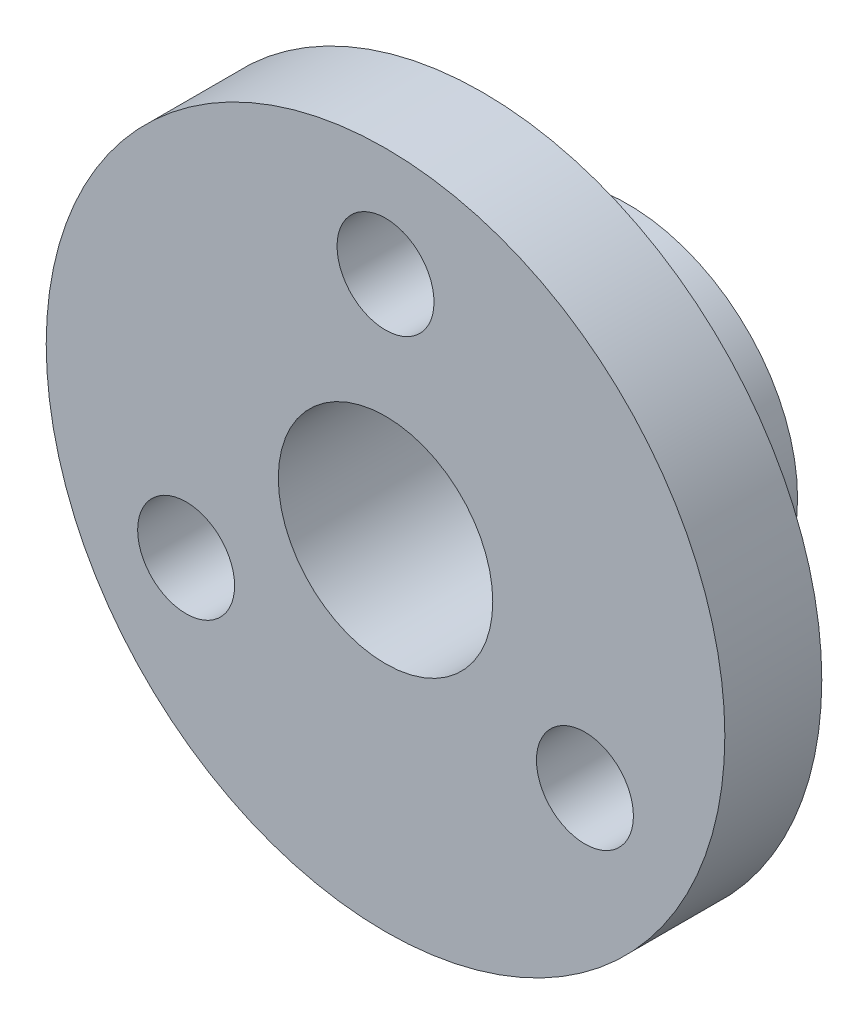
ISO-10303-21;
HEADER;
FILE_DESCRIPTION(('STEP AP214'),'2;1');
FILE_NAME('part.step','',(''),(''),'','','');
FILE_SCHEMA(('AUTOMOTIVE_DESIGN { 1 0 10303 214 1 1 1 1 }'));
ENDSEC;
DATA;
#1=APPLICATION_CONTEXT('core data for automotive mechanical design processes');
#2=APPLICATION_PROTOCOL_DEFINITION('international standard','automotive_design',2000,#1);
#3=PRODUCT_CONTEXT('',#1,'mechanical');
#4=PRODUCT('Part','Part','',(#3));
#5=PRODUCT_RELATED_PRODUCT_CATEGORY('part','',(#4));
#6=PRODUCT_DEFINITION_FORMATION('','',#4);
#7=PRODUCT_DEFINITION_CONTEXT('part definition',#1,'design');
#8=PRODUCT_DEFINITION('design','',#6,#7);
#9=PRODUCT_DEFINITION_SHAPE('','',#8);
#10=(LENGTH_UNIT() NAMED_UNIT(*) SI_UNIT(.MILLI.,.METRE.));
#11=(NAMED_UNIT(*) PLANE_ANGLE_UNIT() SI_UNIT($,.RADIAN.));
#12=(NAMED_UNIT(*) SI_UNIT($,.STERADIAN.) SOLID_ANGLE_UNIT());
#13=UNCERTAINTY_MEASURE_WITH_UNIT(LENGTH_MEASURE(1.E-05),#10,'distance_accuracy_value','');
#14=(GEOMETRIC_REPRESENTATION_CONTEXT(3) GLOBAL_UNCERTAINTY_ASSIGNED_CONTEXT((#13)) GLOBAL_UNIT_ASSIGNED_CONTEXT((#10,
#11,#12)) REPRESENTATION_CONTEXT('',''));
#15=CARTESIAN_POINT('',(0.,0.,0.));
#16=DIRECTION('',(0.,0.,1.));
#17=DIRECTION('',(1.,0.,0.));
#18=AXIS2_PLACEMENT_3D('',#15,#16,#17);
#19=CARTESIAN_POINT('',(-30.7119273786528,-38.9047607864826,2.));
#20=DIRECTION('',(0.,0.,1.));
#21=DIRECTION('',(1.,0.,0.));
#22=AXIS2_PLACEMENT_3D('',#19,#20,#21);
#23=PLANE('',#22);
#24=CARTESIAN_POINT('',(-30.7119273786528,-34.1547607864826,2.));
#25=DIRECTION('',(0.,0.,1.));
#26=DIRECTION('',(1.,0.,0.));
#27=AXIS2_PLACEMENT_3D('',#24,#25,#26);
#28=CIRCLE('',#27,0.999999999999998);
#29=CARTESIAN_POINT('',(-29.7119273786528,-34.1547607864826,2.));
#30=VERTEX_POINT('',#29);
#31=EDGE_CURVE('E53',#30,#30,#28,.T.);
#32=ORIENTED_EDGE('',*,*,#31,.F.);
#33=EDGE_LOOP('',(#32));
#34=FACE_BOUND('',#33,.T.);
#35=CARTESIAN_POINT('',(-34.8255480466291,-41.2797607864825,2.));
#36=DIRECTION('',(0.,0.,1.));
#37=DIRECTION('',(1.,0.,0.));
#38=AXIS2_PLACEMENT_3D('',#35,#36,#37);
#39=CIRCLE('',#38,0.999999999999999);
#40=CARTESIAN_POINT('',(-33.8255480466291,-41.2797607864825,2.));
#41=VERTEX_POINT('',#40);
#42=EDGE_CURVE('E56',#41,#41,#39,.T.);
#43=ORIENTED_EDGE('',*,*,#42,.F.);
#44=EDGE_LOOP('',(#43));
#45=FACE_BOUND('',#44,.T.);
#46=CARTESIAN_POINT('',(-26.5983067106769,-41.2797607864827,2.));
#47=DIRECTION('',(0.,0.,1.));
#48=DIRECTION('',(1.,0.,0.));
#49=AXIS2_PLACEMENT_3D('',#46,#47,#48);
#50=CIRCLE('',#49,0.999999999999996);
#51=CARTESIAN_POINT('',(-25.5983067106769,-41.2797607864827,2.));
#52=VERTEX_POINT('',#51);
#53=EDGE_CURVE('E59',#52,#52,#50,.T.);
#54=ORIENTED_EDGE('',*,*,#53,.F.);
#55=EDGE_LOOP('',(#54));
#56=FACE_BOUND('',#55,.T.);
#57=CARTESIAN_POINT('',(-30.7119273786528,-38.9047607864826,2.));
#58=DIRECTION('',(0.,0.,1.));
#59=DIRECTION('',(1.,0.,0.));
#60=AXIS2_PLACEMENT_3D('',#57,#58,#59);
#61=CIRCLE('',#60,7.);
#62=CARTESIAN_POINT('',(-23.7119273786528,-38.9047607864826,2.));
#63=VERTEX_POINT('',#62);
#64=EDGE_CURVE('E10',#63,#63,#61,.T.);
#65=ORIENTED_EDGE('',*,*,#64,.T.);
#66=EDGE_LOOP('',(#65));
#67=FACE_BOUND('',#66,.T.);
#68=CARTESIAN_POINT('',(-30.7119273786528,-38.9047607864826,2.));
#69=DIRECTION('',(0.,0.,1.));
#70=DIRECTION('',(1.,0.,0.));
#71=AXIS2_PLACEMENT_3D('',#68,#69,#70);
#72=CIRCLE('',#71,2.21235507289356);
#73=CARTESIAN_POINT('',(-28.4995723057593,-38.9047607864826,2.));
#74=VERTEX_POINT('',#73);
#75=EDGE_CURVE('E43',#74,#74,#72,.T.);
#76=ORIENTED_EDGE('',*,*,#75,.F.);
#77=EDGE_LOOP('',(#76));
#78=FACE_BOUND('',#77,.T.);
#79=ADVANCED_FACE('F30',(#34,#45,#56,#67,#78),#23,.T.);
#80=CARTESIAN_POINT('',(-30.7119273786528,-38.9047607864826,0.));
#81=DIRECTION('',(0.,0.,1.));
#82=DIRECTION('',(1.,0.,0.));
#83=AXIS2_PLACEMENT_3D('',#80,#81,#82);
#84=PLANE('',#83);
#85=CARTESIAN_POINT('',(-30.7119273786528,-34.1547607864826,0.));
#86=DIRECTION('',(0.,0.,-1.));
#87=DIRECTION('',(-1.,0.,0.));
#88=AXIS2_PLACEMENT_3D('',#85,#86,#87);
#89=CIRCLE('',#88,0.999999999999998);
#90=CARTESIAN_POINT('',(-31.7119273786528,-34.1547607864826,0.));
#91=VERTEX_POINT('',#90);
#92=EDGE_CURVE('E62',#91,#91,#89,.T.);
#93=ORIENTED_EDGE('',*,*,#92,.F.);
#94=EDGE_LOOP('',(#93));
#95=FACE_BOUND('',#94,.T.);
#96=CARTESIAN_POINT('',(-34.8255480466291,-41.2797607864825,0.));
#97=DIRECTION('',(0.,0.,-1.));
#98=DIRECTION('',(-1.,0.,0.));
#99=AXIS2_PLACEMENT_3D('',#96,#97,#98);
#100=CIRCLE('',#99,0.999999999999999);
#101=CARTESIAN_POINT('',(-35.8255480466291,-41.2797607864825,0.));
#102=VERTEX_POINT('',#101);
#103=EDGE_CURVE('E66',#102,#102,#100,.T.);
#104=ORIENTED_EDGE('',*,*,#103,.F.);
#105=EDGE_LOOP('',(#104));
#106=FACE_BOUND('',#105,.T.);
#107=CARTESIAN_POINT('',(-26.5983067106769,-41.2797607864827,0.));
#108=DIRECTION('',(0.,0.,-1.));
#109=DIRECTION('',(-1.,0.,0.));
#110=AXIS2_PLACEMENT_3D('',#107,#108,#109);
#111=CIRCLE('',#110,0.999999999999996);
#112=CARTESIAN_POINT('',(-27.5983067106769,-41.2797607864827,0.));
#113=VERTEX_POINT('',#112);
#114=EDGE_CURVE('E63',#113,#113,#111,.T.);
#115=ORIENTED_EDGE('',*,*,#114,.F.);
#116=EDGE_LOOP('',(#115));
#117=FACE_BOUND('',#116,.T.);
#118=CARTESIAN_POINT('',(-30.7119273786528,-38.9047607864826,0.));
#119=DIRECTION('',(0.,0.,1.));
#120=DIRECTION('',(1.,0.,0.));
#121=AXIS2_PLACEMENT_3D('',#118,#119,#120);
#122=CIRCLE('',#121,3.5);
#123=CARTESIAN_POINT('',(-27.2119273786528,-38.9047607864826,0.));
#124=VERTEX_POINT('',#123);
#125=EDGE_CURVE('E34',#124,#124,#122,.T.);
#126=ORIENTED_EDGE('',*,*,#125,.T.);
#127=EDGE_LOOP('',(#126));
#128=FACE_BOUND('',#127,.T.);
#129=CARTESIAN_POINT('',(-30.7119273786528,-38.9047607864826,0.));
#130=DIRECTION('',(0.,0.,1.));
#131=DIRECTION('',(1.,0.,0.));
#132=AXIS2_PLACEMENT_3D('',#129,#130,#131);
#133=CIRCLE('',#132,7.);
#134=CARTESIAN_POINT('',(-23.7119273786528,-38.9047607864826,0.));
#135=VERTEX_POINT('',#134);
#136=EDGE_CURVE('E38',#135,#135,#133,.T.);
#137=ORIENTED_EDGE('',*,*,#136,.F.);
#138=EDGE_LOOP('',(#137));
#139=FACE_BOUND('',#138,.T.);
#140=ADVANCED_FACE('F74',(#95,#106,#117,#128,#139),#84,.F.);
#141=CARTESIAN_POINT('',(-30.7119273786528,-38.9047607864826,2.));
#142=DIRECTION('',(0.,0.,-1.));
#143=DIRECTION('',(-1.,0.,0.));
#144=AXIS2_PLACEMENT_3D('',#141,#142,#143);
#145=CYLINDRICAL_SURFACE('',#144,7.);
#146=ORIENTED_EDGE('',*,*,#64,.F.);
#147=EDGE_LOOP('',(#146));
#148=FACE_BOUND('',#147,.T.);
#149=ORIENTED_EDGE('',*,*,#136,.T.);
#150=EDGE_LOOP('',(#149));
#151=FACE_BOUND('',#150,.T.);
#152=ADVANCED_FACE('F32',(#148,#151),#145,.T.);
#153=CARTESIAN_POINT('',(-30.7119273786528,-38.9047607864826,2.));
#154=DIRECTION('',(0.,0.,-1.));
#155=DIRECTION('',(-1.,0.,0.));
#156=AXIS2_PLACEMENT_3D('',#153,#154,#155);
#157=CYLINDRICAL_SURFACE('',#156,2.21235507289356);
#158=ORIENTED_EDGE('',*,*,#75,.T.);
#159=EDGE_LOOP('',(#158));
#160=FACE_BOUND('',#159,.T.);
#161=CARTESIAN_POINT('',(-30.7119273786528,-38.9047607864826,-3.));
#162=DIRECTION('',(0.,0.,1.));
#163=DIRECTION('',(1.,0.,0.));
#164=AXIS2_PLACEMENT_3D('',#161,#162,#163);
#165=CIRCLE('',#164,2.21235507289356);
#166=CARTESIAN_POINT('',(-28.4995723057593,-38.9047607864826,-3.));
#167=VERTEX_POINT('',#166);
#168=EDGE_CURVE('E50',#167,#167,#165,.T.);
#169=ORIENTED_EDGE('',*,*,#168,.F.);
#170=EDGE_LOOP('',(#169));
#171=FACE_BOUND('',#170,.T.);
#172=ADVANCED_FACE('F87',(#160,#171),#157,.F.);
#173=CARTESIAN_POINT('',(-30.7119273786528,-38.9047607864826,-3.));
#174=DIRECTION('',(0.,0.,1.));
#175=DIRECTION('',(1.,0.,0.));
#176=AXIS2_PLACEMENT_3D('',#173,#174,#175);
#177=CYLINDRICAL_SURFACE('',#176,3.5);
#178=CARTESIAN_POINT('',(-30.7119273786528,-38.9047607864826,-3.));
#179=DIRECTION('',(0.,0.,1.));
#180=DIRECTION('',(1.,0.,0.));
#181=AXIS2_PLACEMENT_3D('',#178,#179,#180);
#182=CIRCLE('',#181,3.5);
#183=CARTESIAN_POINT('',(-27.2119273786528,-38.9047607864826,-3.));
#184=VERTEX_POINT('',#183);
#185=EDGE_CURVE('E47',#184,#184,#182,.T.);
#186=ORIENTED_EDGE('',*,*,#185,.T.);
#187=EDGE_LOOP('',(#186));
#188=FACE_BOUND('',#187,.T.);
#189=ORIENTED_EDGE('',*,*,#125,.F.);
#190=EDGE_LOOP('',(#189));
#191=FACE_BOUND('',#190,.T.);
#192=ADVANCED_FACE('F92',(#188,#191),#177,.T.);
#193=CARTESIAN_POINT('',(-30.7119273786528,-38.9047607864826,-3.));
#194=DIRECTION('',(0.,0.,1.));
#195=DIRECTION('',(1.,0.,0.));
#196=AXIS2_PLACEMENT_3D('',#193,#194,#195);
#197=PLANE('',#196);
#198=ORIENTED_EDGE('',*,*,#168,.T.);
#199=EDGE_LOOP('',(#198));
#200=FACE_BOUND('',#199,.T.);
#201=ORIENTED_EDGE('',*,*,#185,.F.);
#202=EDGE_LOOP('',(#201));
#203=FACE_BOUND('',#202,.T.);
#204=ADVANCED_FACE('F105',(#200,#203),#197,.F.);
#205=CARTESIAN_POINT('',(-26.5983067106769,-41.2797607864827,5.));
#206=DIRECTION('',(0.,0.,-1.));
#207=DIRECTION('',(-1.,0.,0.));
#208=AXIS2_PLACEMENT_3D('',#205,#206,#207);
#209=CYLINDRICAL_SURFACE('',#208,0.999999999999996);
#210=ORIENTED_EDGE('',*,*,#53,.T.);
#211=EDGE_LOOP('',(#210));
#212=FACE_BOUND('',#211,.T.);
#213=ORIENTED_EDGE('',*,*,#114,.T.);
#214=EDGE_LOOP('',(#213));
#215=FACE_BOUND('',#214,.T.);
#216=ADVANCED_FACE('F109',(#212,#215),#209,.F.);
#217=CARTESIAN_POINT('',(-34.8255480466291,-41.2797607864825,5.));
#218=DIRECTION('',(0.,0.,-1.));
#219=DIRECTION('',(-1.,0.,0.));
#220=AXIS2_PLACEMENT_3D('',#217,#218,#219);
#221=CYLINDRICAL_SURFACE('',#220,0.999999999999999);
#222=ORIENTED_EDGE('',*,*,#42,.T.);
#223=EDGE_LOOP('',(#222));
#224=FACE_BOUND('',#223,.T.);
#225=ORIENTED_EDGE('',*,*,#103,.T.);
#226=EDGE_LOOP('',(#225));
#227=FACE_BOUND('',#226,.T.);
#228=ADVANCED_FACE('F113',(#224,#227),#221,.F.);
#229=CARTESIAN_POINT('',(-30.7119273786528,-34.1547607864826,5.));
#230=DIRECTION('',(0.,0.,-1.));
#231=DIRECTION('',(-1.,0.,0.));
#232=AXIS2_PLACEMENT_3D('',#229,#230,#231);
#233=CYLINDRICAL_SURFACE('',#232,0.999999999999998);
#234=ORIENTED_EDGE('',*,*,#31,.T.);
#235=EDGE_LOOP('',(#234));
#236=FACE_BOUND('',#235,.T.);
#237=ORIENTED_EDGE('',*,*,#92,.T.);
#238=EDGE_LOOP('',(#237));
#239=FACE_BOUND('',#238,.T.);
#240=ADVANCED_FACE('F72',(#236,#239),#233,.F.);
#241=CLOSED_SHELL('',(#79,#140,#152,#172,#192,#204,#216,#228,#240));
#242=MANIFOLD_SOLID_BREP('B2',#241);
#243=ADVANCED_BREP_SHAPE_REPRESENTATION('',(#18,#242),#14);
#244=SHAPE_DEFINITION_REPRESENTATION(#9,#243);
ENDSEC;
END-ISO-10303-21;
